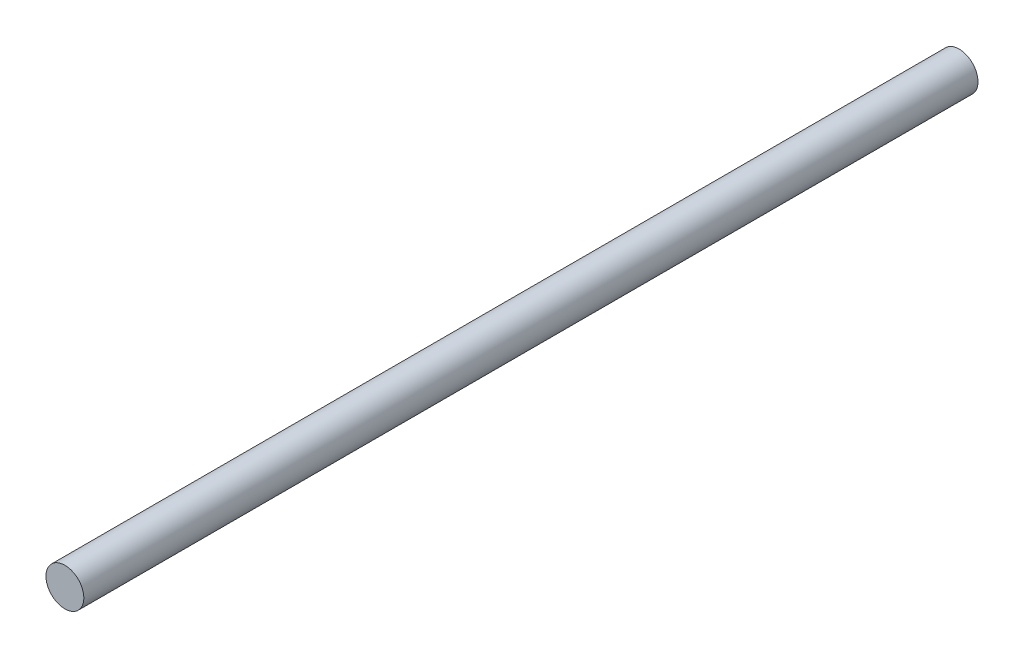
ISO-10303-21;
HEADER;
FILE_DESCRIPTION(('STEP AP214'),'2;1');
FILE_NAME('part.step','',(''),(''),'','','');
FILE_SCHEMA(('AUTOMOTIVE_DESIGN { 1 0 10303 214 1 1 1 1 }'));
ENDSEC;
DATA;
#1=APPLICATION_CONTEXT('core data for automotive mechanical design processes');
#2=APPLICATION_PROTOCOL_DEFINITION('international standard','automotive_design',2000,#1);
#3=PRODUCT_CONTEXT('',#1,'mechanical');
#4=PRODUCT('Part','Part','',(#3));
#5=PRODUCT_RELATED_PRODUCT_CATEGORY('part','',(#4));
#6=PRODUCT_DEFINITION_FORMATION('','',#4);
#7=PRODUCT_DEFINITION_CONTEXT('part definition',#1,'design');
#8=PRODUCT_DEFINITION('design','',#6,#7);
#9=PRODUCT_DEFINITION_SHAPE('','',#8);
#10=(LENGTH_UNIT() NAMED_UNIT(*) SI_UNIT(.MILLI.,.METRE.));
#11=(NAMED_UNIT(*) PLANE_ANGLE_UNIT() SI_UNIT($,.RADIAN.));
#12=(NAMED_UNIT(*) SI_UNIT($,.STERADIAN.) SOLID_ANGLE_UNIT());
#13=UNCERTAINTY_MEASURE_WITH_UNIT(LENGTH_MEASURE(1.E-05),#10,'distance_accuracy_value','');
#14=(GEOMETRIC_REPRESENTATION_CONTEXT(3) GLOBAL_UNCERTAINTY_ASSIGNED_CONTEXT((#13)) GLOBAL_UNIT_ASSIGNED_CONTEXT((#10,
#11,#12)) REPRESENTATION_CONTEXT('',''));
#15=CARTESIAN_POINT('',(0.,0.,0.));
#16=DIRECTION('',(0.,0.,1.));
#17=DIRECTION('',(1.,0.,0.));
#18=AXIS2_PLACEMENT_3D('',#15,#16,#17);
#19=CARTESIAN_POINT('',(0.,0.,-300.));
#20=DIRECTION('',(0.,0.,1.));
#21=DIRECTION('',(1.,0.,0.));
#22=AXIS2_PLACEMENT_3D('',#19,#20,#21);
#23=CYLINDRICAL_SURFACE('',#22,6.35);
#24=CARTESIAN_POINT('',(0.,0.,-300.));
#25=DIRECTION('',(0.,0.,1.));
#26=DIRECTION('',(1.,0.,0.));
#27=AXIS2_PLACEMENT_3D('',#24,#25,#26);
#28=CIRCLE('',#27,6.35);
#29=CARTESIAN_POINT('',(6.35,0.,-300.));
#30=VERTEX_POINT('',#29);
#31=EDGE_CURVE('E10',#30,#30,#28,.T.);
#32=ORIENTED_EDGE('',*,*,#31,.T.);
#33=EDGE_LOOP('',(#32));
#34=FACE_BOUND('',#33,.T.);
#35=CARTESIAN_POINT('',(0.,0.,0.));
#36=DIRECTION('',(0.,0.,1.));
#37=DIRECTION('',(1.,0.,0.));
#38=AXIS2_PLACEMENT_3D('',#35,#36,#37);
#39=CIRCLE('',#38,6.35);
#40=CARTESIAN_POINT('',(6.35,0.,0.));
#41=VERTEX_POINT('',#40);
#42=EDGE_CURVE('E34',#41,#41,#39,.T.);
#43=ORIENTED_EDGE('',*,*,#42,.F.);
#44=EDGE_LOOP('',(#43));
#45=FACE_BOUND('',#44,.T.);
#46=ADVANCED_FACE('F31',(#34,#45),#23,.T.);
#47=CARTESIAN_POINT('',(0.,0.,-300.));
#48=DIRECTION('',(0.,0.,1.));
#49=DIRECTION('',(1.,0.,0.));
#50=AXIS2_PLACEMENT_3D('',#47,#48,#49);
#51=PLANE('',#50);
#52=ORIENTED_EDGE('',*,*,#31,.F.);
#53=EDGE_LOOP('',(#52));
#54=FACE_BOUND('',#53,.T.);
#55=ADVANCED_FACE('F46',(#54),#51,.F.);
#56=CARTESIAN_POINT('',(0.,0.,0.));
#57=DIRECTION('',(0.,0.,1.));
#58=DIRECTION('',(1.,0.,0.));
#59=AXIS2_PLACEMENT_3D('',#56,#57,#58);
#60=PLANE('',#59);
#61=ORIENTED_EDGE('',*,*,#42,.T.);
#62=EDGE_LOOP('',(#61));
#63=FACE_BOUND('',#62,.T.);
#64=ADVANCED_FACE('F43',(#63),#60,.T.);
#65=CLOSED_SHELL('',(#46,#55,#64));
#66=MANIFOLD_SOLID_BREP('B2',#65);
#67=ADVANCED_BREP_SHAPE_REPRESENTATION('',(#18,#66),#14);
#68=SHAPE_DEFINITION_REPRESENTATION(#9,#67);
ENDSEC;
END-ISO-10303-21;
